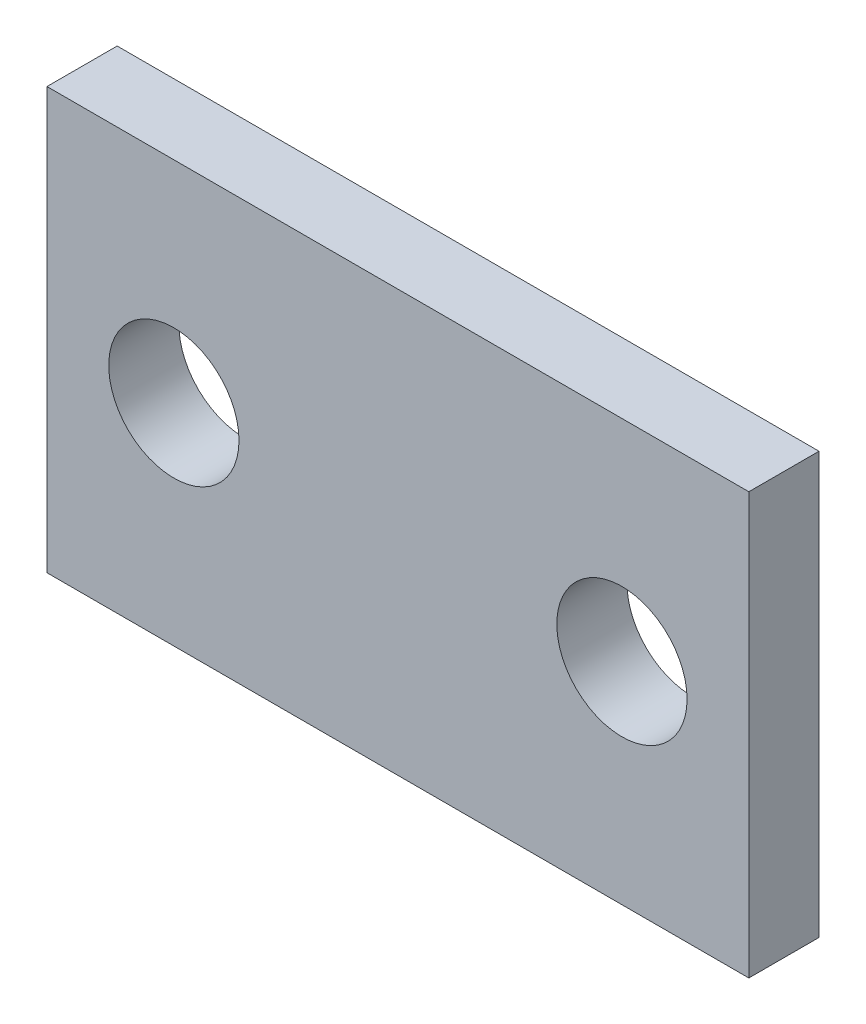
ISO-10303-21;
HEADER;
FILE_DESCRIPTION(('STEP AP214'),'2;1');
FILE_NAME('part.step','',(''),(''),'','','');
FILE_SCHEMA(('AUTOMOTIVE_DESIGN { 1 0 10303 214 1 1 1 1 }'));
ENDSEC;
DATA;
#1=APPLICATION_CONTEXT('core data for automotive mechanical design processes');
#2=APPLICATION_PROTOCOL_DEFINITION('international standard','automotive_design',2000,#1);
#3=PRODUCT_CONTEXT('',#1,'mechanical');
#4=PRODUCT('Part','Part','',(#3));
#5=PRODUCT_RELATED_PRODUCT_CATEGORY('part','',(#4));
#6=PRODUCT_DEFINITION_FORMATION('','',#4);
#7=PRODUCT_DEFINITION_CONTEXT('part definition',#1,'design');
#8=PRODUCT_DEFINITION('design','',#6,#7);
#9=PRODUCT_DEFINITION_SHAPE('','',#8);
#10=(LENGTH_UNIT() NAMED_UNIT(*) SI_UNIT(.MILLI.,.METRE.));
#11=(NAMED_UNIT(*) PLANE_ANGLE_UNIT() SI_UNIT($,.RADIAN.));
#12=(NAMED_UNIT(*) SI_UNIT($,.STERADIAN.) SOLID_ANGLE_UNIT());
#13=UNCERTAINTY_MEASURE_WITH_UNIT(LENGTH_MEASURE(1.E-05),#10,'distance_accuracy_value','');
#14=(GEOMETRIC_REPRESENTATION_CONTEXT(3) GLOBAL_UNCERTAINTY_ASSIGNED_CONTEXT((#13)) GLOBAL_UNIT_ASSIGNED_CONTEXT((#10,
#11,#12)) REPRESENTATION_CONTEXT('',''));
#15=CARTESIAN_POINT('',(0.,0.,0.));
#16=DIRECTION('',(0.,0.,1.));
#17=DIRECTION('',(1.,0.,0.));
#18=AXIS2_PLACEMENT_3D('',#15,#16,#17);
#19=CARTESIAN_POINT('',(7.9375,4.76250000000001,-1.5875));
#20=DIRECTION('',(-1.,0.,0.));
#21=DIRECTION('',(0.,-1.,0.));
#22=AXIS2_PLACEMENT_3D('',#19,#20,#21);
#23=PLANE('',#22);
#24=DIRECTION('',(0.,1.,0.));
#25=VECTOR('',#24,1.);
#26=CARTESIAN_POINT('',(7.9375,4.76250000000001,0.));
#27=LINE('',#26,#25);
#28=CARTESIAN_POINT('',(7.9375,-4.7625,0.));
#29=VERTEX_POINT('',#28);
#30=CARTESIAN_POINT('',(7.9375,4.76250000000001,0.));
#31=VERTEX_POINT('',#30);
#32=EDGE_CURVE('E96',#29,#31,#27,.T.);
#33=ORIENTED_EDGE('',*,*,#32,.F.);
#34=DIRECTION('',(0.,0.,1.));
#35=VECTOR('',#34,1.);
#36=CARTESIAN_POINT('',(7.9375,-4.7625,-1.5875));
#37=LINE('',#36,#35);
#38=CARTESIAN_POINT('',(7.9375,-4.7625,-1.5875));
#39=VERTEX_POINT('',#38);
#40=EDGE_CURVE('E95',#39,#29,#37,.T.);
#41=ORIENTED_EDGE('',*,*,#40,.F.);
#42=DIRECTION('',(0.,1.,0.));
#43=VECTOR('',#42,1.);
#44=CARTESIAN_POINT('',(7.9375,4.76250000000001,-1.5875));
#45=LINE('',#44,#43);
#46=CARTESIAN_POINT('',(7.9375,4.76250000000001,-1.5875));
#47=VERTEX_POINT('',#46);
#48=EDGE_CURVE('E89',#39,#47,#45,.T.);
#49=ORIENTED_EDGE('',*,*,#48,.T.);
#50=DIRECTION('',(0.,0.,1.));
#51=VECTOR('',#50,1.);
#52=CARTESIAN_POINT('',(7.9375,4.76250000000001,-1.5875));
#53=LINE('',#52,#51);
#54=EDGE_CURVE('E11',#47,#31,#53,.T.);
#55=ORIENTED_EDGE('',*,*,#54,.T.);
#56=EDGE_LOOP('',(#33,#41,#49,#55));
#57=FACE_BOUND('',#56,.T.);
#58=ADVANCED_FACE('F32',(#57),#23,.F.);
#59=CARTESIAN_POINT('',(-7.9375,4.76250000000001,-1.5875));
#60=DIRECTION('',(0.,-1.,0.));
#61=DIRECTION('',(0.,0.,1.));
#62=AXIS2_PLACEMENT_3D('',#59,#60,#61);
#63=PLANE('',#62);
#64=DIRECTION('',(-1.,0.,0.));
#65=VECTOR('',#64,1.);
#66=CARTESIAN_POINT('',(-7.9375,4.76250000000001,0.));
#67=LINE('',#66,#65);
#68=CARTESIAN_POINT('',(-7.9375,4.76250000000001,0.));
#69=VERTEX_POINT('',#68);
#70=EDGE_CURVE('E98',#31,#69,#67,.T.);
#71=ORIENTED_EDGE('',*,*,#70,.F.);
#72=ORIENTED_EDGE('',*,*,#54,.F.);
#73=DIRECTION('',(-1.,0.,0.));
#74=VECTOR('',#73,1.);
#75=CARTESIAN_POINT('',(-7.9375,4.76250000000001,-1.5875));
#76=LINE('',#75,#74);
#77=CARTESIAN_POINT('',(-7.9375,4.76250000000001,-1.5875));
#78=VERTEX_POINT('',#77);
#79=EDGE_CURVE('E73',#47,#78,#76,.T.);
#80=ORIENTED_EDGE('',*,*,#79,.T.);
#81=DIRECTION('',(0.,0.,1.));
#82=VECTOR('',#81,1.);
#83=CARTESIAN_POINT('',(-7.9375,4.76250000000001,-1.5875));
#84=LINE('',#83,#82);
#85=EDGE_CURVE('E40',#78,#69,#84,.T.);
#86=ORIENTED_EDGE('',*,*,#85,.T.);
#87=EDGE_LOOP('',(#71,#72,#80,#86));
#88=FACE_BOUND('',#87,.T.);
#89=ADVANCED_FACE('F87',(#88),#63,.F.);
#90=CARTESIAN_POINT('',(-7.9375,4.76250000000001,-1.5875));
#91=DIRECTION('',(1.,0.,0.));
#92=DIRECTION('',(0.,1.,0.));
#93=AXIS2_PLACEMENT_3D('',#90,#91,#92);
#94=PLANE('',#93);
#95=DIRECTION('',(0.,-1.,0.));
#96=VECTOR('',#95,1.);
#97=CARTESIAN_POINT('',(-7.9375,4.76250000000001,0.));
#98=LINE('',#97,#96);
#99=CARTESIAN_POINT('',(-7.9375,-4.7625,0.));
#100=VERTEX_POINT('',#99);
#101=EDGE_CURVE('E83',#69,#100,#98,.T.);
#102=ORIENTED_EDGE('',*,*,#101,.F.);
#103=ORIENTED_EDGE('',*,*,#85,.F.);
#104=DIRECTION('',(0.,-1.,0.));
#105=VECTOR('',#104,1.);
#106=CARTESIAN_POINT('',(-7.9375,4.76250000000001,-1.5875));
#107=LINE('',#106,#105);
#108=CARTESIAN_POINT('',(-7.9375,-4.7625,-1.5875));
#109=VERTEX_POINT('',#108);
#110=EDGE_CURVE('E76',#78,#109,#107,.T.);
#111=ORIENTED_EDGE('',*,*,#110,.T.);
#112=DIRECTION('',(0.,0.,1.));
#113=VECTOR('',#112,1.);
#114=CARTESIAN_POINT('',(-7.9375,-4.7625,-1.5875));
#115=LINE('',#114,#113);
#116=EDGE_CURVE('E86',#109,#100,#115,.T.);
#117=ORIENTED_EDGE('',*,*,#116,.T.);
#118=EDGE_LOOP('',(#102,#103,#111,#117));
#119=FACE_BOUND('',#118,.T.);
#120=ADVANCED_FACE('F82',(#119),#94,.F.);
#121=CARTESIAN_POINT('',(-7.9375,-4.7625,-1.5875));
#122=DIRECTION('',(0.,1.,0.));
#123=DIRECTION('',(0.,0.,-1.));
#124=AXIS2_PLACEMENT_3D('',#121,#122,#123);
#125=PLANE('',#124);
#126=DIRECTION('',(1.,0.,0.));
#127=VECTOR('',#126,1.);
#128=CARTESIAN_POINT('',(-7.9375,-4.7625,0.));
#129=LINE('',#128,#127);
#130=EDGE_CURVE('E62',#100,#29,#129,.T.);
#131=ORIENTED_EDGE('',*,*,#130,.F.);
#132=ORIENTED_EDGE('',*,*,#116,.F.);
#133=DIRECTION('',(1.,0.,0.));
#134=VECTOR('',#133,1.);
#135=CARTESIAN_POINT('',(-7.9375,-4.7625,-1.5875));
#136=LINE('',#135,#134);
#137=EDGE_CURVE('E48',#109,#39,#136,.T.);
#138=ORIENTED_EDGE('',*,*,#137,.T.);
#139=ORIENTED_EDGE('',*,*,#40,.T.);
#140=EDGE_LOOP('',(#131,#132,#138,#139));
#141=FACE_BOUND('',#140,.T.);
#142=ADVANCED_FACE('F108',(#141),#125,.F.);
#143=CARTESIAN_POINT('',(7.9375,-4.7625,-1.5875));
#144=DIRECTION('',(0.,0.,-1.));
#145=DIRECTION('',(1.,0.,0.));
#146=AXIS2_PLACEMENT_3D('',#143,#144,#145);
#147=PLANE('',#146);
#148=CARTESIAN_POINT('',(-5.0673,0.,-1.5875));
#149=DIRECTION('',(0.,0.,1.));
#150=DIRECTION('',(1.,0.,0.));
#151=AXIS2_PLACEMENT_3D('',#148,#149,#150);
#152=CIRCLE('',#151,1.47319999999999);
#153=CARTESIAN_POINT('',(-3.59410000000001,0.,-1.5875));
#154=VERTEX_POINT('',#153);
#155=EDGE_CURVE('E177',#154,#154,#152,.T.);
#156=ORIENTED_EDGE('',*,*,#155,.T.);
#157=EDGE_LOOP('',(#156));
#158=FACE_BOUND('',#157,.T.);
#159=CARTESIAN_POINT('',(5.0673,0.,-1.5875));
#160=DIRECTION('',(0.,0.,1.));
#161=DIRECTION('',(1.,0.,0.));
#162=AXIS2_PLACEMENT_3D('',#159,#160,#161);
#163=CIRCLE('',#162,1.47319999999999);
#164=CARTESIAN_POINT('',(6.54049999999999,0.,-1.5875));
#165=VERTEX_POINT('',#164);
#166=EDGE_CURVE('E179',#165,#165,#163,.T.);
#167=ORIENTED_EDGE('',*,*,#166,.T.);
#168=EDGE_LOOP('',(#167));
#169=FACE_BOUND('',#168,.T.);
#170=ORIENTED_EDGE('',*,*,#48,.F.);
#171=ORIENTED_EDGE('',*,*,#137,.F.);
#172=ORIENTED_EDGE('',*,*,#110,.F.);
#173=ORIENTED_EDGE('',*,*,#79,.F.);
#174=EDGE_LOOP('',(#170,#171,#172,#173));
#175=FACE_BOUND('',#174,.T.);
#176=ADVANCED_FACE('F78',(#158,#169,#175),#147,.T.);
#177=CARTESIAN_POINT('',(7.9375,-4.7625,0.));
#178=DIRECTION('',(0.,0.,-1.));
#179=DIRECTION('',(1.,0.,0.));
#180=AXIS2_PLACEMENT_3D('',#177,#178,#179);
#181=PLANE('',#180);
#182=CARTESIAN_POINT('',(-5.0673,0.,0.));
#183=DIRECTION('',(0.,0.,1.));
#184=DIRECTION('',(1.,0.,0.));
#185=AXIS2_PLACEMENT_3D('',#182,#183,#184);
#186=CIRCLE('',#185,1.47319999999999);
#187=CARTESIAN_POINT('',(-3.59410000000001,0.,0.));
#188=VERTEX_POINT('',#187);
#189=EDGE_CURVE('E174',#188,#188,#186,.T.);
#190=ORIENTED_EDGE('',*,*,#189,.F.);
#191=EDGE_LOOP('',(#190));
#192=FACE_BOUND('',#191,.T.);
#193=CARTESIAN_POINT('',(5.0673,0.,0.));
#194=DIRECTION('',(0.,0.,1.));
#195=DIRECTION('',(1.,0.,0.));
#196=AXIS2_PLACEMENT_3D('',#193,#194,#195);
#197=CIRCLE('',#196,1.47319999999999);
#198=CARTESIAN_POINT('',(6.54049999999999,0.,0.));
#199=VERTEX_POINT('',#198);
#200=EDGE_CURVE('E99',#199,#199,#197,.T.);
#201=ORIENTED_EDGE('',*,*,#200,.F.);
#202=EDGE_LOOP('',(#201));
#203=FACE_BOUND('',#202,.T.);
#204=ORIENTED_EDGE('',*,*,#32,.T.);
#205=ORIENTED_EDGE('',*,*,#70,.T.);
#206=ORIENTED_EDGE('',*,*,#101,.T.);
#207=ORIENTED_EDGE('',*,*,#130,.T.);
#208=EDGE_LOOP('',(#204,#205,#206,#207));
#209=FACE_BOUND('',#208,.T.);
#210=ADVANCED_FACE('F104',(#192,#203,#209),#181,.F.);
#211=CARTESIAN_POINT('',(5.0673,0.,-1.5875));
#212=DIRECTION('',(0.,0.,-1.));
#213=DIRECTION('',(1.,0.,0.));
#214=AXIS2_PLACEMENT_3D('',#211,#212,#213);
#215=CYLINDRICAL_SURFACE('',#214,1.47319999999999);
#216=ORIENTED_EDGE('',*,*,#200,.T.);
#217=EDGE_LOOP('',(#216));
#218=FACE_BOUND('',#217,.T.);
#219=ORIENTED_EDGE('',*,*,#166,.F.);
#220=EDGE_LOOP('',(#219));
#221=FACE_BOUND('',#220,.T.);
#222=ADVANCED_FACE('F148',(#218,#221),#215,.F.);
#223=CARTESIAN_POINT('',(-5.0673,0.,-1.5875));
#224=DIRECTION('',(0.,0.,-1.));
#225=DIRECTION('',(1.,0.,0.));
#226=AXIS2_PLACEMENT_3D('',#223,#224,#225);
#227=CYLINDRICAL_SURFACE('',#226,1.47319999999999);
#228=ORIENTED_EDGE('',*,*,#189,.T.);
#229=EDGE_LOOP('',(#228));
#230=FACE_BOUND('',#229,.T.);
#231=ORIENTED_EDGE('',*,*,#155,.F.);
#232=EDGE_LOOP('',(#231));
#233=FACE_BOUND('',#232,.T.);
#234=ADVANCED_FACE('F157',(#230,#233),#227,.F.);
#235=CLOSED_SHELL('',(#58,#89,#120,#142,#176,#210,#222,#234));
#236=MANIFOLD_SOLID_BREP('B2',#235);
#237=ADVANCED_BREP_SHAPE_REPRESENTATION('',(#18,#236),#14);
#238=SHAPE_DEFINITION_REPRESENTATION(#9,#237);
ENDSEC;
END-ISO-10303-21;
